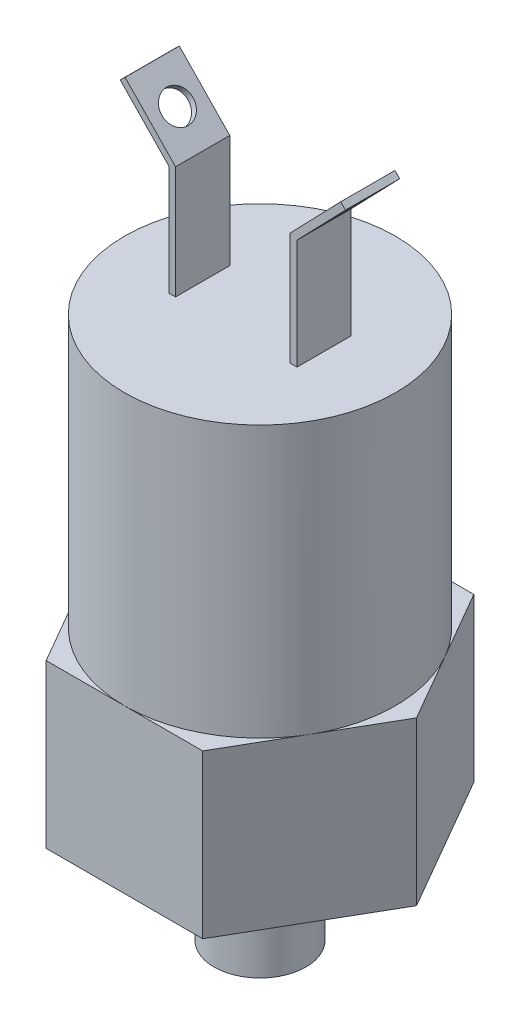
ISO-10303-21;
HEADER;
FILE_DESCRIPTION(('STEP AP214'),'2;1');
FILE_NAME('part.step','',(''),(''),'','','');
FILE_SCHEMA(('AUTOMOTIVE_DESIGN { 1 0 10303 214 1 1 1 1 }'));
ENDSEC;
DATA;
#1=APPLICATION_CONTEXT('core data for automotive mechanical design processes');
#2=APPLICATION_PROTOCOL_DEFINITION('international standard','automotive_design',2000,#1);
#3=PRODUCT_CONTEXT('',#1,'mechanical');
#4=PRODUCT('Part','Part','',(#3));
#5=PRODUCT_RELATED_PRODUCT_CATEGORY('part','',(#4));
#6=PRODUCT_DEFINITION_FORMATION('','',#4);
#7=PRODUCT_DEFINITION_CONTEXT('part definition',#1,'design');
#8=PRODUCT_DEFINITION('design','',#6,#7);
#9=PRODUCT_DEFINITION_SHAPE('','',#8);
#10=(LENGTH_UNIT() NAMED_UNIT(*) SI_UNIT(.MILLI.,.METRE.));
#11=(NAMED_UNIT(*) PLANE_ANGLE_UNIT() SI_UNIT($,.RADIAN.));
#12=(NAMED_UNIT(*) SI_UNIT($,.STERADIAN.) SOLID_ANGLE_UNIT());
#13=UNCERTAINTY_MEASURE_WITH_UNIT(LENGTH_MEASURE(1.E-05),#10,'distance_accuracy_value','');
#14=(GEOMETRIC_REPRESENTATION_CONTEXT(3) GLOBAL_UNCERTAINTY_ASSIGNED_CONTEXT((#13)) GLOBAL_UNIT_ASSIGNED_CONTEXT((#10,
#11,#12)) REPRESENTATION_CONTEXT('',''));
#15=CARTESIAN_POINT('',(0.,0.,0.));
#16=DIRECTION('',(0.,0.,1.));
#17=DIRECTION('',(1.,0.,0.));
#18=AXIS2_PLACEMENT_3D('',#15,#16,#17);
#19=CARTESIAN_POINT('',(-5.91916388064722,50.854740059957,2.54));
#20=DIRECTION('',(-0.719626723782185,-0.694361129685785,0.));
#21=DIRECTION('',(0.694361129685785,-0.719626723782185,0.));
#22=AXIS2_PLACEMENT_3D('',#19,#20,#21);
#23=PLANE('',#22);
#24=DIRECTION('',(-0.694361129685785,0.719626723782185,0.));
#25=VECTOR('',#24,1.);
#26=CARTESIAN_POINT('',(-5.91916388064722,50.854740059957,-2.54));
#27=LINE('',#26,#25);
#28=CARTESIAN_POINT('',(-6.00818239584637,50.9469976759295,-2.54));
#29=VERTEX_POINT('',#28);
#30=CARTESIAN_POINT('',(-10.5552709637061,55.6595403413248,-2.54));
#31=VERTEX_POINT('',#30);
#32=EDGE_CURVE('E182',#29,#31,#27,.T.);
#33=ORIENTED_EDGE('',*,*,#32,.F.);
#34=DIRECTION('',(0.,0.,-1.));
#35=VECTOR('',#34,1.);
#36=CARTESIAN_POINT('',(-6.00818239584637,50.9469976759295,2.54));
#37=LINE('',#36,#35);
#38=CARTESIAN_POINT('',(-6.00818239584637,50.9469976759295,2.54));
#39=VERTEX_POINT('',#38);
#40=EDGE_CURVE('E177',#39,#29,#37,.T.);
#41=ORIENTED_EDGE('',*,*,#40,.F.);
#42=DIRECTION('',(-0.694361129685785,0.719626723782185,0.));
#43=VECTOR('',#42,1.);
#44=CARTESIAN_POINT('',(-5.91916388064722,50.854740059957,2.54));
#45=LINE('',#44,#43);
#46=CARTESIAN_POINT('',(-10.5552709637061,55.6595403413248,2.54));
#47=VERTEX_POINT('',#46);
#48=EDGE_CURVE('E180',#39,#47,#45,.T.);
#49=ORIENTED_EDGE('',*,*,#48,.T.);
#50=DIRECTION('',(0.,0.,-1.));
#51=VECTOR('',#50,1.);
#52=CARTESIAN_POINT('',(-10.5552709637061,55.6595403413248,2.54));
#53=LINE('',#52,#51);
#54=EDGE_CURVE('E209',#47,#31,#53,.T.);
#55=ORIENTED_EDGE('',*,*,#54,.T.);
#56=EDGE_LOOP('',(#33,#41,#49,#55));
#57=FACE_BOUND('',#56,.T.);
#58=CARTESIAN_POINT('',(-8.19270816457709,53.2110113926547,0.));
#59=DIRECTION('',(-0.719626723782185,-0.694361129685785,0.));
#60=DIRECTION('',(0.694361129685785,-0.719626723782185,0.));
#61=AXIS2_PLACEMENT_3D('',#58,#59,#60);
#62=CIRCLE('',#61,1.4605);
#63=CARTESIAN_POINT('',(-7.17859373467101,52.1599965625708,0.));
#64=VERTEX_POINT('',#63);
#65=EDGE_CURVE('E212',#64,#64,#62,.T.);
#66=ORIENTED_EDGE('',*,*,#65,.F.);
#67=EDGE_LOOP('',(#66));
#68=FACE_BOUND('',#67,.T.);
#69=ADVANCED_FACE('F36',(#57,#68),#23,.T.);
#70=CARTESIAN_POINT('',(-5.46220091104553,51.2956593773075,2.54));
#71=DIRECTION('',(-0.719626723782185,-0.694361129685785,0.));
#72=DIRECTION('',(0.694361129685785,-0.719626723782185,0.));
#73=AXIS2_PLACEMENT_3D('',#70,#71,#72);
#74=PLANE('',#73);
#75=DIRECTION('',(-0.694361129685785,0.719626723782185,0.));
#76=VECTOR('',#75,1.);
#77=CARTESIAN_POINT('',(-5.46220091104553,51.2956593773075,-2.54));
#78=LINE('',#77,#76);
#79=CARTESIAN_POINT('',(-5.37318239584637,51.2034017613351,-2.54));
#80=VERTEX_POINT('',#79);
#81=CARTESIAN_POINT('',(-10.0983079941044,56.1004596586752,-2.54));
#82=VERTEX_POINT('',#81);
#83=EDGE_CURVE('E218',#80,#82,#78,.T.);
#84=ORIENTED_EDGE('',*,*,#83,.T.);
#85=DIRECTION('',(0.,0.,-1.));
#86=VECTOR('',#85,1.);
#87=CARTESIAN_POINT('',(-10.0983079941044,56.1004596586752,2.54));
#88=LINE('',#87,#86);
#89=CARTESIAN_POINT('',(-10.0983079941044,56.1004596586752,2.54));
#90=VERTEX_POINT('',#89);
#91=EDGE_CURVE('E223',#90,#82,#88,.T.);
#92=ORIENTED_EDGE('',*,*,#91,.F.);
#93=DIRECTION('',(-0.694361129685785,0.719626723782185,0.));
#94=VECTOR('',#93,1.);
#95=CARTESIAN_POINT('',(-5.46220091104553,51.2956593773075,2.54));
#96=LINE('',#95,#94);
#97=CARTESIAN_POINT('',(-5.37318239584637,51.2034017613351,2.54));
#98=VERTEX_POINT('',#97);
#99=EDGE_CURVE('E206',#98,#90,#96,.T.);
#100=ORIENTED_EDGE('',*,*,#99,.F.);
#101=DIRECTION('',(0.,0.,-1.));
#102=VECTOR('',#101,1.);
#103=CARTESIAN_POINT('',(-5.37318239584637,51.2034017613351,2.54));
#104=LINE('',#103,#102);
#105=EDGE_CURVE('E226',#98,#80,#104,.T.);
#106=ORIENTED_EDGE('',*,*,#105,.T.);
#107=EDGE_LOOP('',(#84,#92,#100,#106));
#108=FACE_BOUND('',#107,.T.);
#109=CARTESIAN_POINT('',(-7.73574519497541,53.6519307100052,0.));
#110=DIRECTION('',(-0.719626723782185,-0.694361129685785,0.));
#111=DIRECTION('',(0.694361129685785,-0.719626723782185,0.));
#112=AXIS2_PLACEMENT_3D('',#109,#110,#111);
#113=CIRCLE('',#112,1.4605);
#114=CARTESIAN_POINT('',(-6.72163076506932,52.6009158799213,0.));
#115=VERTEX_POINT('',#114);
#116=EDGE_CURVE('E678',#115,#115,#113,.T.);
#117=ORIENTED_EDGE('',*,*,#116,.T.);
#118=EDGE_LOOP('',(#117));
#119=FACE_BOUND('',#118,.T.);
#120=ADVANCED_FACE('F418',(#108,#119),#74,.F.);
#121=CARTESIAN_POINT('',(0.,40.64,0.));
#122=DIRECTION('',(0.,1.,0.));
#123=DIRECTION('',(0.,0.,1.));
#124=AXIS2_PLACEMENT_3D('',#121,#122,#123);
#125=PLANE('',#124);
#126=DIRECTION('',(0.,0.,-1.));
#127=VECTOR('',#126,1.);
#128=CARTESIAN_POINT('',(6.00818239584637,40.64,2.54));
#129=LINE('',#128,#127);
#130=CARTESIAN_POINT('',(6.00818239584637,40.64,2.54));
#131=VERTEX_POINT('',#130);
#132=CARTESIAN_POINT('',(6.00818239584637,40.64,-2.54));
#133=VERTEX_POINT('',#132);
#134=EDGE_CURVE('E271',#131,#133,#129,.T.);
#135=ORIENTED_EDGE('',*,*,#134,.F.);
#136=DIRECTION('',(-1.,0.,0.));
#137=VECTOR('',#136,1.);
#138=CARTESIAN_POINT('',(6.00818239584637,40.64,2.54));
#139=LINE('',#138,#137);
#140=CARTESIAN_POINT('',(5.37318239584637,40.64,2.54));
#141=VERTEX_POINT('',#140);
#142=EDGE_CURVE('E249',#131,#141,#139,.T.);
#143=ORIENTED_EDGE('',*,*,#142,.T.);
#144=DIRECTION('',(0.,0.,-1.));
#145=VECTOR('',#144,1.);
#146=CARTESIAN_POINT('',(5.37318239584637,40.64,2.54));
#147=LINE('',#146,#145);
#148=CARTESIAN_POINT('',(5.37318239584637,40.64,-2.54));
#149=VERTEX_POINT('',#148);
#150=EDGE_CURVE('E274',#141,#149,#147,.T.);
#151=ORIENTED_EDGE('',*,*,#150,.T.);
#152=DIRECTION('',(-1.,0.,0.));
#153=VECTOR('',#152,1.);
#154=CARTESIAN_POINT('',(6.00818239584637,40.64,-2.54));
#155=LINE('',#154,#153);
#156=EDGE_CURVE('E265',#133,#149,#155,.T.);
#157=ORIENTED_EDGE('',*,*,#156,.F.);
#158=EDGE_LOOP('',(#135,#143,#151,#157));
#159=FACE_BOUND('',#158,.T.);
#160=CARTESIAN_POINT('',(0.,40.64,0.));
#161=DIRECTION('',(0.,1.,0.));
#162=DIRECTION('',(0.,0.,1.));
#163=AXIS2_PLACEMENT_3D('',#160,#161,#162);
#164=CIRCLE('',#163,12.7);
#165=CARTESIAN_POINT('',(0.,40.64,12.7));
#166=VERTEX_POINT('',#165);
#167=EDGE_CURVE('E286',#166,#166,#164,.T.);
#168=ORIENTED_EDGE('',*,*,#167,.T.);
#169=EDGE_LOOP('',(#168));
#170=FACE_BOUND('',#169,.T.);
#171=DIRECTION('',(0.,0.,-1.));
#172=VECTOR('',#171,1.);
#173=CARTESIAN_POINT('',(-5.37318239584637,40.64,2.54));
#174=LINE('',#173,#172);
#175=CARTESIAN_POINT('',(-5.37318239584637,40.64,2.54));
#176=VERTEX_POINT('',#175);
#177=CARTESIAN_POINT('',(-5.37318239584637,40.64,-2.54));
#178=VERTEX_POINT('',#177);
#179=EDGE_CURVE('E56',#176,#178,#174,.T.);
#180=ORIENTED_EDGE('',*,*,#179,.F.);
#181=DIRECTION('',(1.,0.,0.));
#182=VECTOR('',#181,1.);
#183=CARTESIAN_POINT('',(-6.00818239584637,40.64,2.54));
#184=LINE('',#183,#182);
#185=CARTESIAN_POINT('',(-6.00818239584637,40.64,2.54));
#186=VERTEX_POINT('',#185);
#187=EDGE_CURVE('E51',#186,#176,#184,.T.);
#188=ORIENTED_EDGE('',*,*,#187,.F.);
#189=DIRECTION('',(0.,0.,-1.));
#190=VECTOR('',#189,1.);
#191=CARTESIAN_POINT('',(-6.00818239584637,40.64,2.54));
#192=LINE('',#191,#190);
#193=CARTESIAN_POINT('',(-6.00818239584637,40.64,-2.54));
#194=VERTEX_POINT('',#193);
#195=EDGE_CURVE('E188',#186,#194,#192,.T.);
#196=ORIENTED_EDGE('',*,*,#195,.T.);
#197=DIRECTION('',(1.,0.,0.));
#198=VECTOR('',#197,1.);
#199=CARTESIAN_POINT('',(-6.00818239584637,40.64,-2.54));
#200=LINE('',#199,#198);
#201=EDGE_CURVE('E214',#194,#178,#200,.T.);
#202=ORIENTED_EDGE('',*,*,#201,.T.);
#203=EDGE_LOOP('',(#180,#188,#196,#202));
#204=FACE_BOUND('',#203,.T.);
#205=ADVANCED_FACE('F423',(#159,#170,#204),#125,.T.);
#206=CARTESIAN_POINT('',(0.,0.,0.));
#207=DIRECTION('',(0.,1.,0.));
#208=DIRECTION('',(0.,0.,1.));
#209=AXIS2_PLACEMENT_3D('',#206,#207,#208);
#210=PLANE('',#209);
#211=DIRECTION('',(-0.5,0.,-0.866025403784439));
#212=VECTOR('',#211,1.);
#213=CARTESIAN_POINT('',(14.6646968374165,0.,0.));
#214=LINE('',#213,#212);
#215=CARTESIAN_POINT('',(14.6646968374165,0.,0.));
#216=VERTEX_POINT('',#215);
#217=CARTESIAN_POINT('',(7.33234841870825,0.,-12.7));
#218=VERTEX_POINT('',#217);
#219=EDGE_CURVE('E289',#216,#218,#214,.T.);
#220=ORIENTED_EDGE('',*,*,#219,.F.);
#221=DIRECTION('',(0.5,0.,-0.866025403784439));
#222=VECTOR('',#221,1.);
#223=CARTESIAN_POINT('',(7.33234841870825,0.,12.7));
#224=LINE('',#223,#222);
#225=CARTESIAN_POINT('',(7.33234841870825,0.,12.7));
#226=VERTEX_POINT('',#225);
#227=EDGE_CURVE('E327',#226,#216,#224,.T.);
#228=ORIENTED_EDGE('',*,*,#227,.F.);
#229=DIRECTION('',(1.,0.,0.));
#230=VECTOR('',#229,1.);
#231=CARTESIAN_POINT('',(-7.33234841870824,0.,12.7));
#232=LINE('',#231,#230);
#233=CARTESIAN_POINT('',(-7.33234841870824,0.,12.7));
#234=VERTEX_POINT('',#233);
#235=EDGE_CURVE('E325',#234,#226,#232,.T.);
#236=ORIENTED_EDGE('',*,*,#235,.F.);
#237=DIRECTION('',(0.5,0.,0.866025403784439));
#238=VECTOR('',#237,1.);
#239=CARTESIAN_POINT('',(-14.6646968374165,0.,0.));
#240=LINE('',#239,#238);
#241=CARTESIAN_POINT('',(-14.6646968374165,0.,0.));
#242=VERTEX_POINT('',#241);
#243=EDGE_CURVE('E323',#242,#234,#240,.T.);
#244=ORIENTED_EDGE('',*,*,#243,.F.);
#245=DIRECTION('',(-0.5,0.,0.866025403784439));
#246=VECTOR('',#245,1.);
#247=CARTESIAN_POINT('',(-7.33234841870825,0.,-12.7));
#248=LINE('',#247,#246);
#249=CARTESIAN_POINT('',(-7.33234841870825,0.,-12.7));
#250=VERTEX_POINT('',#249);
#251=EDGE_CURVE('E321',#250,#242,#248,.T.);
#252=ORIENTED_EDGE('',*,*,#251,.F.);
#253=DIRECTION('',(-1.,0.,0.));
#254=VECTOR('',#253,1.);
#255=CARTESIAN_POINT('',(7.33234841870825,0.,-12.7));
#256=LINE('',#255,#254);
#257=EDGE_CURVE('E319',#218,#250,#256,.T.);
#258=ORIENTED_EDGE('',*,*,#257,.F.);
#259=EDGE_LOOP('',(#220,#228,#236,#244,#252,#258));
#260=FACE_BOUND('',#259,.T.);
#261=CARTESIAN_POINT('',(0.,0.,0.));
#262=DIRECTION('',(0.,1.,0.));
#263=DIRECTION('',(0.,0.,1.));
#264=AXIS2_PLACEMENT_3D('',#261,#262,#263);
#265=CIRCLE('',#264,4.3053);
#266=CARTESIAN_POINT('',(0.,0.,4.3053));
#267=VERTEX_POINT('',#266);
#268=EDGE_CURVE('E11',#267,#267,#265,.F.);
#269=ORIENTED_EDGE('',*,*,#268,.F.);
#270=EDGE_LOOP('',(#269));
#271=FACE_BOUND('',#270,.T.);
#272=ADVANCED_FACE('F377',(#260,#271),#210,.F.);
#273=CARTESIAN_POINT('',(0.,15.24,0.));
#274=DIRECTION('',(0.,1.,0.));
#275=DIRECTION('',(0.,0.,1.));
#276=AXIS2_PLACEMENT_3D('',#273,#274,#275);
#277=PLANE('',#276);
#278=CARTESIAN_POINT('',(0.,15.24,0.));
#279=DIRECTION('',(0.,1.,0.));
#280=DIRECTION('',(0.,0.,1.));
#281=AXIS2_PLACEMENT_3D('',#278,#279,#280);
#282=CIRCLE('',#281,12.7);
#283=CARTESIAN_POINT('',(0.,15.24,12.7));
#284=VERTEX_POINT('',#283);
#285=CARTESIAN_POINT('',(10.9985226280624,15.24,6.35));
#286=VERTEX_POINT('',#285);
#287=EDGE_CURVE('E285',#284,#286,#282,.T.);
#288=ORIENTED_EDGE('',*,*,#287,.F.);
#289=DIRECTION('',(1.,0.,0.));
#290=VECTOR('',#289,1.);
#291=CARTESIAN_POINT('',(-7.33234841870824,15.24,12.7));
#292=LINE('',#291,#290);
#293=CARTESIAN_POINT('',(7.33234841870825,15.24,12.7));
#294=VERTEX_POINT('',#293);
#295=EDGE_CURVE('E309',#284,#294,#292,.T.);
#296=ORIENTED_EDGE('',*,*,#295,.T.);
#297=DIRECTION('',(0.5,0.,-0.866025403784439));
#298=VECTOR('',#297,1.);
#299=CARTESIAN_POINT('',(7.33234841870825,15.24,12.7));
#300=LINE('',#299,#298);
#301=EDGE_CURVE('E313',#294,#286,#300,.T.);
#302=ORIENTED_EDGE('',*,*,#301,.T.);
#303=EDGE_LOOP('',(#288,#296,#302));
#304=FACE_BOUND('',#303,.T.);
#305=ADVANCED_FACE('F367',(#304),#277,.T.);
#306=CARTESIAN_POINT('',(10.9985226280624,15.24,-6.35));
#307=VERTEX_POINT('',#306);
#308=EDGE_CURVE('E44',#286,#307,#282,.T.);
#309=ORIENTED_EDGE('',*,*,#308,.F.);
#310=CARTESIAN_POINT('',(14.6646968374165,15.24,0.));
#311=VERTEX_POINT('',#310);
#312=EDGE_CURVE('E312',#286,#311,#300,.T.);
#313=ORIENTED_EDGE('',*,*,#312,.T.);
#314=DIRECTION('',(-0.5,0.,-0.866025403784439));
#315=VECTOR('',#314,1.);
#316=CARTESIAN_POINT('',(14.6646968374165,15.24,0.));
#317=LINE('',#316,#315);
#318=EDGE_CURVE('E293',#311,#307,#317,.T.);
#319=ORIENTED_EDGE('',*,*,#318,.T.);
#320=EDGE_LOOP('',(#309,#313,#319));
#321=FACE_BOUND('',#320,.T.);
#322=ADVANCED_FACE('F360',(#321),#277,.T.);
#323=CARTESIAN_POINT('',(0.,15.24,-12.7));
#324=VERTEX_POINT('',#323);
#325=EDGE_CURVE('E353',#307,#324,#282,.T.);
#326=ORIENTED_EDGE('',*,*,#325,.F.);
#327=CARTESIAN_POINT('',(7.33234841870825,15.24,-12.7));
#328=VERTEX_POINT('',#327);
#329=EDGE_CURVE('E297',#307,#328,#317,.T.);
#330=ORIENTED_EDGE('',*,*,#329,.T.);
#331=DIRECTION('',(-1.,0.,0.));
#332=VECTOR('',#331,1.);
#333=CARTESIAN_POINT('',(7.33234841870825,15.24,-12.7));
#334=LINE('',#333,#332);
#335=EDGE_CURVE('E298',#328,#324,#334,.T.);
#336=ORIENTED_EDGE('',*,*,#335,.T.);
#337=EDGE_LOOP('',(#326,#330,#336));
#338=FACE_BOUND('',#337,.T.);
#339=ADVANCED_FACE('F384',(#338),#277,.T.);
#340=CARTESIAN_POINT('',(-10.9985226280624,15.24,-6.35));
#341=VERTEX_POINT('',#340);
#342=EDGE_CURVE('E351',#324,#341,#282,.T.);
#343=ORIENTED_EDGE('',*,*,#342,.F.);
#344=CARTESIAN_POINT('',(-7.33234841870825,15.24,-12.7));
#345=VERTEX_POINT('',#344);
#346=EDGE_CURVE('E296',#324,#345,#334,.T.);
#347=ORIENTED_EDGE('',*,*,#346,.T.);
#348=DIRECTION('',(-0.5,0.,0.866025403784439));
#349=VECTOR('',#348,1.);
#350=CARTESIAN_POINT('',(-7.33234841870825,15.24,-12.7));
#351=LINE('',#350,#349);
#352=EDGE_CURVE('E302',#345,#341,#351,.T.);
#353=ORIENTED_EDGE('',*,*,#352,.T.);
#354=EDGE_LOOP('',(#343,#347,#353));
#355=FACE_BOUND('',#354,.T.);
#356=ADVANCED_FACE('F390',(#355),#277,.T.);
#357=CARTESIAN_POINT('',(-10.9985226280624,15.24,6.35));
#358=VERTEX_POINT('',#357);
#359=EDGE_CURVE('E348',#341,#358,#282,.T.);
#360=ORIENTED_EDGE('',*,*,#359,.F.);
#361=CARTESIAN_POINT('',(-14.6646968374165,15.24,0.));
#362=VERTEX_POINT('',#361);
#363=EDGE_CURVE('E301',#341,#362,#351,.T.);
#364=ORIENTED_EDGE('',*,*,#363,.T.);
#365=DIRECTION('',(0.5,0.,0.866025403784439));
#366=VECTOR('',#365,1.);
#367=CARTESIAN_POINT('',(-14.6646968374165,15.24,0.));
#368=LINE('',#367,#366);
#369=EDGE_CURVE('E306',#362,#358,#368,.T.);
#370=ORIENTED_EDGE('',*,*,#369,.T.);
#371=EDGE_LOOP('',(#360,#364,#370));
#372=FACE_BOUND('',#371,.T.);
#373=ADVANCED_FACE('F397',(#372),#277,.T.);
#374=CARTESIAN_POINT('',(14.6646968374165,15.24,0.));
#375=DIRECTION('',(-0.866025403784439,0.,0.5));
#376=DIRECTION('',(0.5,0.,0.866025403784439));
#377=AXIS2_PLACEMENT_3D('',#374,#375,#376);
#378=PLANE('',#377);
#379=ORIENTED_EDGE('',*,*,#219,.T.);
#380=DIRECTION('',(0.,-1.,0.));
#381=VECTOR('',#380,1.);
#382=CARTESIAN_POINT('',(7.33234841870825,15.24,-12.7));
#383=LINE('',#382,#381);
#384=EDGE_CURVE('E342',#328,#218,#383,.T.);
#385=ORIENTED_EDGE('',*,*,#384,.F.);
#386=ORIENTED_EDGE('',*,*,#329,.F.);
#387=ORIENTED_EDGE('',*,*,#318,.F.);
#388=DIRECTION('',(0.,-1.,0.));
#389=VECTOR('',#388,1.);
#390=CARTESIAN_POINT('',(14.6646968374165,15.24,0.));
#391=LINE('',#390,#389);
#392=EDGE_CURVE('E316',#311,#216,#391,.T.);
#393=ORIENTED_EDGE('',*,*,#392,.T.);
#394=EDGE_LOOP('',(#379,#385,#386,#387,#393));
#395=FACE_BOUND('',#394,.T.);
#396=ADVANCED_FACE('F38',(#395),#378,.F.);
#397=CARTESIAN_POINT('',(7.33234841870825,15.24,-12.7));
#398=DIRECTION('',(0.,0.,1.));
#399=DIRECTION('',(1.,0.,0.));
#400=AXIS2_PLACEMENT_3D('',#397,#398,#399);
#401=PLANE('',#400);
#402=ORIENTED_EDGE('',*,*,#257,.T.);
#403=DIRECTION('',(0.,-1.,0.));
#404=VECTOR('',#403,1.);
#405=CARTESIAN_POINT('',(-7.33234841870825,15.24,-12.7));
#406=LINE('',#405,#404);
#407=EDGE_CURVE('E340',#345,#250,#406,.T.);
#408=ORIENTED_EDGE('',*,*,#407,.F.);
#409=ORIENTED_EDGE('',*,*,#346,.F.);
#410=ORIENTED_EDGE('',*,*,#335,.F.);
#411=ORIENTED_EDGE('',*,*,#384,.T.);
#412=EDGE_LOOP('',(#402,#408,#409,#410,#411));
#413=FACE_BOUND('',#412,.T.);
#414=ADVANCED_FACE('F386',(#413),#401,.F.);
#415=CARTESIAN_POINT('',(-7.33234841870825,15.24,-12.7));
#416=DIRECTION('',(0.866025403784439,0.,0.5));
#417=DIRECTION('',(0.5,0.,-0.866025403784439));
#418=AXIS2_PLACEMENT_3D('',#415,#416,#417);
#419=PLANE('',#418);
#420=ORIENTED_EDGE('',*,*,#251,.T.);
#421=DIRECTION('',(0.,-1.,0.));
#422=VECTOR('',#421,1.);
#423=CARTESIAN_POINT('',(-14.6646968374165,15.24,0.));
#424=LINE('',#423,#422);
#425=EDGE_CURVE('E337',#362,#242,#424,.T.);
#426=ORIENTED_EDGE('',*,*,#425,.F.);
#427=ORIENTED_EDGE('',*,*,#363,.F.);
#428=ORIENTED_EDGE('',*,*,#352,.F.);
#429=ORIENTED_EDGE('',*,*,#407,.T.);
#430=EDGE_LOOP('',(#420,#426,#427,#428,#429));
#431=FACE_BOUND('',#430,.T.);
#432=ADVANCED_FACE('F393',(#431),#419,.F.);
#433=CARTESIAN_POINT('',(-14.6646968374165,15.24,0.));
#434=DIRECTION('',(0.866025403784439,0.,-0.5));
#435=DIRECTION('',(-0.5,0.,-0.866025403784439));
#436=AXIS2_PLACEMENT_3D('',#433,#434,#435);
#437=PLANE('',#436);
#438=ORIENTED_EDGE('',*,*,#243,.T.);
#439=DIRECTION('',(0.,-1.,0.));
#440=VECTOR('',#439,1.);
#441=CARTESIAN_POINT('',(-7.33234841870824,15.24,12.7));
#442=LINE('',#441,#440);
#443=CARTESIAN_POINT('',(-7.33234841870824,15.24,12.7));
#444=VERTEX_POINT('',#443);
#445=EDGE_CURVE('E334',#444,#234,#442,.T.);
#446=ORIENTED_EDGE('',*,*,#445,.F.);
#447=EDGE_CURVE('E305',#358,#444,#368,.T.);
#448=ORIENTED_EDGE('',*,*,#447,.F.);
#449=ORIENTED_EDGE('',*,*,#369,.F.);
#450=ORIENTED_EDGE('',*,*,#425,.T.);
#451=EDGE_LOOP('',(#438,#446,#448,#449,#450));
#452=FACE_BOUND('',#451,.T.);
#453=ADVANCED_FACE('F400',(#452),#437,.F.);
#454=CARTESIAN_POINT('',(-7.33234841870824,15.24,12.7));
#455=DIRECTION('',(0.,0.,-1.));
#456=DIRECTION('',(-1.,0.,0.));
#457=AXIS2_PLACEMENT_3D('',#454,#455,#456);
#458=PLANE('',#457);
#459=ORIENTED_EDGE('',*,*,#235,.T.);
#460=DIRECTION('',(0.,-1.,0.));
#461=VECTOR('',#460,1.);
#462=CARTESIAN_POINT('',(7.33234841870825,15.24,12.7));
#463=LINE('',#462,#461);
#464=EDGE_CURVE('E331',#294,#226,#463,.T.);
#465=ORIENTED_EDGE('',*,*,#464,.F.);
#466=ORIENTED_EDGE('',*,*,#295,.F.);
#467=EDGE_CURVE('E310',#444,#284,#292,.T.);
#468=ORIENTED_EDGE('',*,*,#467,.F.);
#469=ORIENTED_EDGE('',*,*,#445,.T.);
#470=EDGE_LOOP('',(#459,#465,#466,#468,#469));
#471=FACE_BOUND('',#470,.T.);
#472=ADVANCED_FACE('F372',(#471),#458,.F.);
#473=CARTESIAN_POINT('',(7.33234841870825,15.24,12.7));
#474=DIRECTION('',(-0.866025403784439,0.,-0.5));
#475=DIRECTION('',(-0.5,0.,0.866025403784439));
#476=AXIS2_PLACEMENT_3D('',#473,#474,#475);
#477=PLANE('',#476);
#478=ORIENTED_EDGE('',*,*,#227,.T.);
#479=ORIENTED_EDGE('',*,*,#392,.F.);
#480=ORIENTED_EDGE('',*,*,#312,.F.);
#481=ORIENTED_EDGE('',*,*,#301,.F.);
#482=ORIENTED_EDGE('',*,*,#464,.T.);
#483=EDGE_LOOP('',(#478,#479,#480,#481,#482));
#484=FACE_BOUND('',#483,.T.);
#485=ADVANCED_FACE('F365',(#484),#477,.F.);
#486=EDGE_CURVE('E292',#358,#284,#282,.T.);
#487=ORIENTED_EDGE('',*,*,#486,.F.);
#488=ORIENTED_EDGE('',*,*,#447,.T.);
#489=ORIENTED_EDGE('',*,*,#467,.T.);
#490=EDGE_LOOP('',(#487,#488,#489));
#491=FACE_BOUND('',#490,.T.);
#492=ADVANCED_FACE('F403',(#491),#277,.T.);
#493=CARTESIAN_POINT('',(0.,40.64,0.));
#494=DIRECTION('',(0.,-1.,0.));
#495=DIRECTION('',(0.,0.,-1.));
#496=AXIS2_PLACEMENT_3D('',#493,#494,#495);
#497=CYLINDRICAL_SURFACE('',#496,12.7);
#498=ORIENTED_EDGE('',*,*,#167,.F.);
#499=EDGE_LOOP('',(#498));
#500=FACE_BOUND('',#499,.T.);
#501=ORIENTED_EDGE('',*,*,#287,.T.);
#502=ORIENTED_EDGE('',*,*,#308,.T.);
#503=ORIENTED_EDGE('',*,*,#325,.T.);
#504=ORIENTED_EDGE('',*,*,#342,.T.);
#505=ORIENTED_EDGE('',*,*,#359,.T.);
#506=ORIENTED_EDGE('',*,*,#486,.T.);
#507=EDGE_LOOP('',(#501,#502,#503,#504,#505,#506));
#508=FACE_BOUND('',#507,.T.);
#509=ADVANCED_FACE('F356',(#500,#508),#497,.T.);
#510=CARTESIAN_POINT('',(0.,-10.16,0.));
#511=DIRECTION('',(0.,1.,0.));
#512=DIRECTION('',(0.,0.,1.));
#513=AXIS2_PLACEMENT_3D('',#510,#511,#512);
#514=CYLINDRICAL_SURFACE('',#513,4.3053);
#515=CARTESIAN_POINT('',(0.,-10.16,0.));
#516=DIRECTION('',(0.,-1.,0.));
#517=DIRECTION('',(0.,0.,-1.));
#518=AXIS2_PLACEMENT_3D('',#515,#516,#517);
#519=CIRCLE('',#518,4.3053);
#520=CARTESIAN_POINT('',(0.,-10.16,-4.3053));
#521=VERTEX_POINT('',#520);
#522=EDGE_CURVE('E282',#521,#521,#519,.T.);
#523=ORIENTED_EDGE('',*,*,#522,.F.);
#524=EDGE_LOOP('',(#523));
#525=FACE_BOUND('',#524,.T.);
#526=ORIENTED_EDGE('',*,*,#268,.T.);
#527=EDGE_LOOP('',(#526));
#528=FACE_BOUND('',#527,.T.);
#529=ADVANCED_FACE('F410',(#525,#528),#514,.T.);
#530=CARTESIAN_POINT('',(0.,-10.16,0.));
#531=DIRECTION('',(0.,-1.,0.));
#532=DIRECTION('',(0.,0.,-1.));
#533=AXIS2_PLACEMENT_3D('',#530,#531,#532);
#534=PLANE('',#533);
#535=ORIENTED_EDGE('',*,*,#522,.T.);
#536=EDGE_LOOP('',(#535));
#537=FACE_BOUND('',#536,.T.);
#538=ADVANCED_FACE('F460',(#537),#534,.T.);
#539=CARTESIAN_POINT('',(5.91916388064722,50.854740059957,2.54));
#540=DIRECTION('',(-0.719626723782185,0.694361129685785,0.));
#541=DIRECTION('',(-0.694361129685785,-0.719626723782185,0.));
#542=AXIS2_PLACEMENT_3D('',#539,#540,#541);
#543=PLANE('',#542);
#544=CARTESIAN_POINT('',(8.19270816457709,53.2110113926547,0.));
#545=DIRECTION('',(-0.719626723782185,0.694361129685785,0.));
#546=DIRECTION('',(-0.694361129685785,-0.719626723782185,0.));
#547=AXIS2_PLACEMENT_3D('',#544,#545,#546);
#548=CIRCLE('',#547,1.4605);
#549=CARTESIAN_POINT('',(7.17859373467101,52.1599965625708,0.));
#550=VERTEX_POINT('',#549);
#551=EDGE_CURVE('E233',#550,#550,#548,.F.);
#552=ORIENTED_EDGE('',*,*,#551,.F.);
#553=EDGE_LOOP('',(#552));
#554=FACE_BOUND('',#553,.T.);
#555=DIRECTION('',(0.694361129685785,0.719626723782185,0.));
#556=VECTOR('',#555,1.);
#557=CARTESIAN_POINT('',(5.91916388064722,50.854740059957,-2.54));
#558=LINE('',#557,#556);
#559=CARTESIAN_POINT('',(6.00818239584637,50.9469976759295,-2.54));
#560=VERTEX_POINT('',#559);
#561=CARTESIAN_POINT('',(10.5552709637061,55.6595403413248,-2.54));
#562=VERTEX_POINT('',#561);
#563=EDGE_CURVE('E236',#560,#562,#558,.T.);
#564=ORIENTED_EDGE('',*,*,#563,.T.);
#565=DIRECTION('',(0.,0.,-1.));
#566=VECTOR('',#565,1.);
#567=CARTESIAN_POINT('',(10.5552709637061,55.6595403413248,2.54));
#568=LINE('',#567,#566);
#569=CARTESIAN_POINT('',(10.5552709637061,55.6595403413248,2.54));
#570=VERTEX_POINT('',#569);
#571=EDGE_CURVE('E280',#570,#562,#568,.T.);
#572=ORIENTED_EDGE('',*,*,#571,.F.);
#573=DIRECTION('',(0.694361129685785,0.719626723782185,0.));
#574=VECTOR('',#573,1.);
#575=CARTESIAN_POINT('',(5.91916388064722,50.854740059957,2.54));
#576=LINE('',#575,#574);
#577=CARTESIAN_POINT('',(6.00818239584637,50.9469976759295,2.54));
#578=VERTEX_POINT('',#577);
#579=EDGE_CURVE('E237',#578,#570,#576,.T.);
#580=ORIENTED_EDGE('',*,*,#579,.F.);
#581=DIRECTION('',(0.,0.,-1.));
#582=VECTOR('',#581,1.);
#583=CARTESIAN_POINT('',(6.00818239584637,50.9469976759295,2.54));
#584=LINE('',#583,#582);
#585=EDGE_CURVE('E253',#578,#560,#584,.T.);
#586=ORIENTED_EDGE('',*,*,#585,.T.);
#587=EDGE_LOOP('',(#564,#572,#580,#586));
#588=FACE_BOUND('',#587,.T.);
#589=ADVANCED_FACE('F456',(#554,#588),#543,.F.);
#590=CARTESIAN_POINT('',(10.0983079941044,56.1004596586752,2.54));
#591=DIRECTION('',(0.694361129685788,0.719626723782182,0.));
#592=DIRECTION('',(-0.719626723782182,0.694361129685788,0.));
#593=AXIS2_PLACEMENT_3D('',#590,#591,#592);
#594=PLANE('',#593);
#595=DIRECTION('',(0.719626723782182,-0.694361129685788,0.));
#596=VECTOR('',#595,1.);
#597=CARTESIAN_POINT('',(10.0983079941044,56.1004596586752,-2.54));
#598=LINE('',#597,#596);
#599=CARTESIAN_POINT('',(10.0983079941044,56.1004596586752,-2.54));
#600=VERTEX_POINT('',#599);
#601=EDGE_CURVE('E256',#600,#562,#598,.T.);
#602=ORIENTED_EDGE('',*,*,#601,.F.);
#603=DIRECTION('',(0.,0.,-1.));
#604=VECTOR('',#603,1.);
#605=CARTESIAN_POINT('',(10.0983079941044,56.1004596586752,2.54));
#606=LINE('',#605,#604);
#607=CARTESIAN_POINT('',(10.0983079941044,56.1004596586752,2.54));
#608=VERTEX_POINT('',#607);
#609=EDGE_CURVE('E278',#608,#600,#606,.T.);
#610=ORIENTED_EDGE('',*,*,#609,.F.);
#611=DIRECTION('',(0.719626723782182,-0.694361129685788,0.));
#612=VECTOR('',#611,1.);
#613=CARTESIAN_POINT('',(10.0983079941044,56.1004596586752,2.54));
#614=LINE('',#613,#612);
#615=EDGE_CURVE('E239',#608,#570,#614,.T.);
#616=ORIENTED_EDGE('',*,*,#615,.T.);
#617=ORIENTED_EDGE('',*,*,#571,.T.);
#618=EDGE_LOOP('',(#602,#610,#616,#617));
#619=FACE_BOUND('',#618,.T.);
#620=ADVANCED_FACE('F452',(#619),#594,.T.);
#621=CARTESIAN_POINT('',(5.46220091104553,51.2956593773075,2.54));
#622=DIRECTION('',(-0.719626723782185,0.694361129685785,0.));
#623=DIRECTION('',(-0.694361129685785,-0.719626723782185,0.));
#624=AXIS2_PLACEMENT_3D('',#621,#622,#623);
#625=PLANE('',#624);
#626=CARTESIAN_POINT('',(7.73574519497541,53.6519307100052,0.));
#627=DIRECTION('',(-0.719626723782185,0.694361129685785,0.));
#628=DIRECTION('',(-0.694361129685785,-0.719626723782185,0.));
#629=AXIS2_PLACEMENT_3D('',#626,#627,#628);
#630=CIRCLE('',#629,1.4605);
#631=CARTESIAN_POINT('',(6.72163076506932,52.6009158799213,0.));
#632=VERTEX_POINT('',#631);
#633=EDGE_CURVE('E187',#632,#632,#630,.T.);
#634=ORIENTED_EDGE('',*,*,#633,.F.);
#635=EDGE_LOOP('',(#634));
#636=FACE_BOUND('',#635,.T.);
#637=DIRECTION('',(0.694361129685785,0.719626723782185,0.));
#638=VECTOR('',#637,1.);
#639=CARTESIAN_POINT('',(5.46220091104553,51.2956593773075,-2.54));
#640=LINE('',#639,#638);
#641=CARTESIAN_POINT('',(5.37318239584637,51.2034017613351,-2.54));
#642=VERTEX_POINT('',#641);
#643=EDGE_CURVE('E259',#642,#600,#640,.T.);
#644=ORIENTED_EDGE('',*,*,#643,.F.);
#645=DIRECTION('',(0.,0.,-1.));
#646=VECTOR('',#645,1.);
#647=CARTESIAN_POINT('',(5.37318239584637,51.2034017613351,2.54));
#648=LINE('',#647,#646);
#649=CARTESIAN_POINT('',(5.37318239584637,51.2034017613351,2.54));
#650=VERTEX_POINT('',#649);
#651=EDGE_CURVE('E276',#650,#642,#648,.T.);
#652=ORIENTED_EDGE('',*,*,#651,.F.);
#653=DIRECTION('',(0.694361129685785,0.719626723782185,0.));
#654=VECTOR('',#653,1.);
#655=CARTESIAN_POINT('',(5.46220091104553,51.2956593773075,2.54));
#656=LINE('',#655,#654);
#657=EDGE_CURVE('E243',#650,#608,#656,.T.);
#658=ORIENTED_EDGE('',*,*,#657,.T.);
#659=ORIENTED_EDGE('',*,*,#609,.T.);
#660=EDGE_LOOP('',(#644,#652,#658,#659));
#661=FACE_BOUND('',#660,.T.);
#662=ADVANCED_FACE('F448',(#636,#661),#625,.T.);
#663=CARTESIAN_POINT('',(5.37318239584637,40.64,2.54));
#664=DIRECTION('',(-1.,0.,0.));
#665=DIRECTION('',(0.,0.,1.));
#666=AXIS2_PLACEMENT_3D('',#663,#664,#665);
#667=PLANE('',#666);
#668=DIRECTION('',(0.,1.,0.));
#669=VECTOR('',#668,1.);
#670=CARTESIAN_POINT('',(5.37318239584637,40.64,-2.54));
#671=LINE('',#670,#669);
#672=EDGE_CURVE('E262',#149,#642,#671,.T.);
#673=ORIENTED_EDGE('',*,*,#672,.F.);
#674=ORIENTED_EDGE('',*,*,#150,.F.);
#675=DIRECTION('',(0.,1.,0.));
#676=VECTOR('',#675,1.);
#677=CARTESIAN_POINT('',(5.37318239584637,40.64,2.54));
#678=LINE('',#677,#676);
#679=EDGE_CURVE('E246',#141,#650,#678,.T.);
#680=ORIENTED_EDGE('',*,*,#679,.T.);
#681=ORIENTED_EDGE('',*,*,#651,.T.);
#682=EDGE_LOOP('',(#673,#674,#680,#681));
#683=FACE_BOUND('',#682,.T.);
#684=ADVANCED_FACE('F444',(#683),#667,.T.);
#685=CARTESIAN_POINT('',(6.00818239584637,40.64,2.54));
#686=DIRECTION('',(-1.,0.,0.));
#687=DIRECTION('',(0.,0.,1.));
#688=AXIS2_PLACEMENT_3D('',#685,#686,#687);
#689=PLANE('',#688);
#690=DIRECTION('',(0.,1.,0.));
#691=VECTOR('',#690,1.);
#692=CARTESIAN_POINT('',(6.00818239584637,40.64,-2.54));
#693=LINE('',#692,#691);
#694=EDGE_CURVE('E240',#133,#560,#693,.T.);
#695=ORIENTED_EDGE('',*,*,#694,.T.);
#696=ORIENTED_EDGE('',*,*,#585,.F.);
#697=DIRECTION('',(0.,1.,0.));
#698=VECTOR('',#697,1.);
#699=CARTESIAN_POINT('',(6.00818239584637,40.64,2.54));
#700=LINE('',#699,#698);
#701=EDGE_CURVE('E251',#131,#578,#700,.T.);
#702=ORIENTED_EDGE('',*,*,#701,.F.);
#703=ORIENTED_EDGE('',*,*,#134,.T.);
#704=EDGE_LOOP('',(#695,#696,#702,#703));
#705=FACE_BOUND('',#704,.T.);
#706=ADVANCED_FACE('F437',(#705),#689,.F.);
#707=CARTESIAN_POINT('',(0.,0.,2.54));
#708=DIRECTION('',(0.,0.,-1.));
#709=DIRECTION('',(-1.,0.,0.));
#710=AXIS2_PLACEMENT_3D('',#707,#708,#709);
#711=PLANE('',#710);
#712=ORIENTED_EDGE('',*,*,#579,.T.);
#713=ORIENTED_EDGE('',*,*,#615,.F.);
#714=ORIENTED_EDGE('',*,*,#657,.F.);
#715=ORIENTED_EDGE('',*,*,#679,.F.);
#716=ORIENTED_EDGE('',*,*,#142,.F.);
#717=ORIENTED_EDGE('',*,*,#701,.T.);
#718=EDGE_LOOP('',(#712,#713,#714,#715,#716,#717));
#719=FACE_BOUND('',#718,.T.);
#720=ADVANCED_FACE('F434',(#719),#711,.F.);
#721=CARTESIAN_POINT('',(0.,0.,-2.54));
#722=DIRECTION('',(0.,0.,-1.));
#723=DIRECTION('',(-1.,0.,0.));
#724=AXIS2_PLACEMENT_3D('',#721,#722,#723);
#725=PLANE('',#724);
#726=ORIENTED_EDGE('',*,*,#563,.F.);
#727=ORIENTED_EDGE('',*,*,#694,.F.);
#728=ORIENTED_EDGE('',*,*,#156,.T.);
#729=ORIENTED_EDGE('',*,*,#672,.T.);
#730=ORIENTED_EDGE('',*,*,#643,.T.);
#731=ORIENTED_EDGE('',*,*,#601,.T.);
#732=EDGE_LOOP('',(#726,#727,#728,#729,#730,#731));
#733=FACE_BOUND('',#732,.T.);
#734=ADVANCED_FACE('F432',(#733),#725,.T.);
#735=CARTESIAN_POINT('',(43.2106059749876,19.4225676352246,0.));
#736=DIRECTION('',(-0.719626723782185,0.694361129685785,0.));
#737=DIRECTION('',(-0.694361129685785,-0.719626723782185,0.));
#738=AXIS2_PLACEMENT_3D('',#735,#736,#737);
#739=CYLINDRICAL_SURFACE('',#738,1.4605);
#740=ORIENTED_EDGE('',*,*,#633,.T.);
#741=EDGE_LOOP('',(#740));
#742=FACE_BOUND('',#741,.T.);
#743=ORIENTED_EDGE('',*,*,#551,.T.);
#744=EDGE_LOOP('',(#743));
#745=FACE_BOUND('',#744,.T.);
#746=ADVANCED_FACE('F429',(#742,#745),#739,.F.);
#747=CARTESIAN_POINT('',(-6.00818239584637,40.64,2.54));
#748=DIRECTION('',(-1.,0.,0.));
#749=DIRECTION('',(0.,0.,1.));
#750=AXIS2_PLACEMENT_3D('',#747,#748,#749);
#751=PLANE('',#750);
#752=DIRECTION('',(0.,1.,0.));
#753=VECTOR('',#752,1.);
#754=CARTESIAN_POINT('',(-6.00818239584637,40.64,-2.54));
#755=LINE('',#754,#753);
#756=EDGE_CURVE('E211',#194,#29,#755,.T.);
#757=ORIENTED_EDGE('',*,*,#756,.F.);
#758=ORIENTED_EDGE('',*,*,#195,.F.);
#759=DIRECTION('',(0.,1.,0.));
#760=VECTOR('',#759,1.);
#761=CARTESIAN_POINT('',(-6.00818239584637,40.64,2.54));
#762=LINE('',#761,#760);
#763=EDGE_CURVE('E193',#186,#39,#762,.T.);
#764=ORIENTED_EDGE('',*,*,#763,.T.);
#765=ORIENTED_EDGE('',*,*,#40,.T.);
#766=EDGE_LOOP('',(#757,#758,#764,#765));
#767=FACE_BOUND('',#766,.T.);
#768=ADVANCED_FACE('F199',(#767),#751,.T.);
#769=CARTESIAN_POINT('',(-5.37318239584637,40.64,2.54));
#770=DIRECTION('',(-1.,0.,0.));
#771=DIRECTION('',(0.,0.,1.));
#772=AXIS2_PLACEMENT_3D('',#769,#770,#771);
#773=PLANE('',#772);
#774=DIRECTION('',(0.,1.,0.));
#775=VECTOR('',#774,1.);
#776=CARTESIAN_POINT('',(-5.37318239584637,40.64,-2.54));
#777=LINE('',#776,#775);
#778=EDGE_CURVE('E216',#178,#80,#777,.T.);
#779=ORIENTED_EDGE('',*,*,#778,.T.);
#780=ORIENTED_EDGE('',*,*,#105,.F.);
#781=DIRECTION('',(0.,1.,0.));
#782=VECTOR('',#781,1.);
#783=CARTESIAN_POINT('',(-5.37318239584637,40.64,2.54));
#784=LINE('',#783,#782);
#785=EDGE_CURVE('E201',#176,#98,#784,.T.);
#786=ORIENTED_EDGE('',*,*,#785,.F.);
#787=ORIENTED_EDGE('',*,*,#179,.T.);
#788=EDGE_LOOP('',(#779,#780,#786,#787));
#789=FACE_BOUND('',#788,.T.);
#790=ADVANCED_FACE('F605',(#789),#773,.F.);
#791=CARTESIAN_POINT('',(-10.0983079941044,56.1004596586752,2.54));
#792=DIRECTION('',(0.694361129685788,-0.719626723782182,0.));
#793=DIRECTION('',(0.719626723782182,0.694361129685788,0.));
#794=AXIS2_PLACEMENT_3D('',#791,#792,#793);
#795=PLANE('',#794);
#796=DIRECTION('',(-0.719626723782182,-0.694361129685788,0.));
#797=VECTOR('',#796,1.);
#798=CARTESIAN_POINT('',(-10.0983079941044,56.1004596586752,-2.54));
#799=LINE('',#798,#797);
#800=EDGE_CURVE('E197',#82,#31,#799,.T.);
#801=ORIENTED_EDGE('',*,*,#800,.T.);
#802=ORIENTED_EDGE('',*,*,#54,.F.);
#803=DIRECTION('',(-0.719626723782182,-0.694361129685788,0.));
#804=VECTOR('',#803,1.);
#805=CARTESIAN_POINT('',(-10.0983079941044,56.1004596586752,2.54));
#806=LINE('',#805,#804);
#807=EDGE_CURVE('E195',#90,#47,#806,.T.);
#808=ORIENTED_EDGE('',*,*,#807,.F.);
#809=ORIENTED_EDGE('',*,*,#91,.T.);
#810=EDGE_LOOP('',(#801,#802,#808,#809));
#811=FACE_BOUND('',#810,.T.);
#812=ADVANCED_FACE('F612',(#811),#795,.F.);
#813=CARTESIAN_POINT('',(0.,0.,2.54));
#814=DIRECTION('',(0.,0.,-1.));
#815=DIRECTION('',(1.,0.,0.));
#816=AXIS2_PLACEMENT_3D('',#813,#814,#815);
#817=PLANE('',#816);
#818=ORIENTED_EDGE('',*,*,#48,.F.);
#819=ORIENTED_EDGE('',*,*,#763,.F.);
#820=ORIENTED_EDGE('',*,*,#187,.T.);
#821=ORIENTED_EDGE('',*,*,#785,.T.);
#822=ORIENTED_EDGE('',*,*,#99,.T.);
#823=ORIENTED_EDGE('',*,*,#807,.T.);
#824=EDGE_LOOP('',(#818,#819,#820,#821,#822,#823));
#825=FACE_BOUND('',#824,.T.);
#826=ADVANCED_FACE('F192',(#825),#817,.F.);
#827=CARTESIAN_POINT('',(0.,0.,-2.54));
#828=DIRECTION('',(0.,0.,-1.));
#829=DIRECTION('',(1.,0.,0.));
#830=AXIS2_PLACEMENT_3D('',#827,#828,#829);
#831=PLANE('',#830);
#832=ORIENTED_EDGE('',*,*,#32,.T.);
#833=ORIENTED_EDGE('',*,*,#800,.F.);
#834=ORIENTED_EDGE('',*,*,#83,.F.);
#835=ORIENTED_EDGE('',*,*,#778,.F.);
#836=ORIENTED_EDGE('',*,*,#201,.F.);
#837=ORIENTED_EDGE('',*,*,#756,.T.);
#838=EDGE_LOOP('',(#832,#833,#834,#835,#836,#837));
#839=FACE_BOUND('',#838,.T.);
#840=ADVANCED_FACE('F628',(#839),#831,.T.);
#841=CARTESIAN_POINT('',(-43.2106059749876,19.4225676352246,0.));
#842=DIRECTION('',(0.719626723782185,0.694361129685785,0.));
#843=DIRECTION('',(-0.694361129685785,0.719626723782185,0.));
#844=AXIS2_PLACEMENT_3D('',#841,#842,#843);
#845=CYLINDRICAL_SURFACE('',#844,1.4605);
#846=ORIENTED_EDGE('',*,*,#65,.T.);
#847=EDGE_LOOP('',(#846));
#848=FACE_BOUND('',#847,.T.);
#849=ORIENTED_EDGE('',*,*,#116,.F.);
#850=EDGE_LOOP('',(#849));
#851=FACE_BOUND('',#850,.T.);
#852=ADVANCED_FACE('F636',(#848,#851),#845,.F.);
#853=CLOSED_SHELL('',(#69,#120,#205,#272,#305,#322,#339,#356,#373,#396,#414,#432,#453,#472,#485,
#492,#509,#529,#538,#589,#620,#662,#684,#706,#720,#734,#746,#768,#790,#812,#826,#840,#852));
#854=MANIFOLD_SOLID_BREP('B2',#853);
#855=ADVANCED_BREP_SHAPE_REPRESENTATION('',(#18,#854),#14);
#856=SHAPE_DEFINITION_REPRESENTATION(#9,#855);
ENDSEC;
END-ISO-10303-21;
